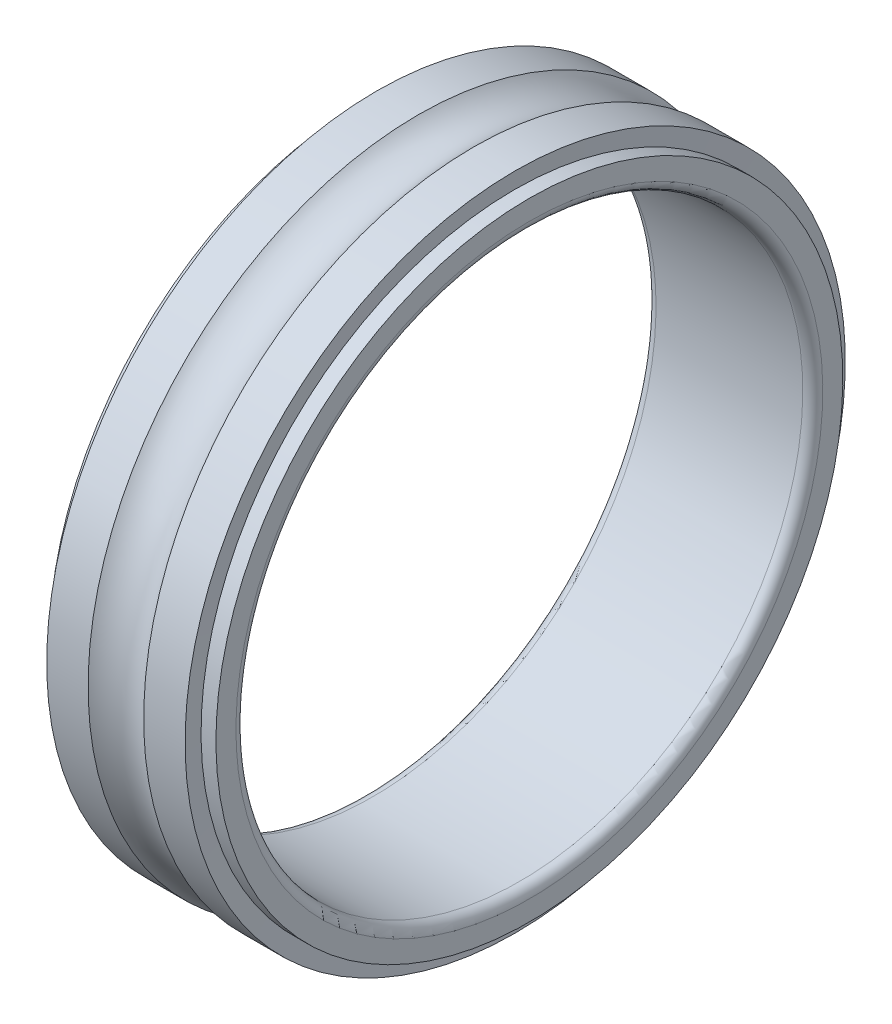
ISO-10303-21;
HEADER;
FILE_DESCRIPTION(('STEP AP214'),'2;1');
FILE_NAME('part.step','',(''),(''),'','','');
FILE_SCHEMA(('AUTOMOTIVE_DESIGN { 1 0 10303 214 1 1 1 1 }'));
ENDSEC;
DATA;
#1=APPLICATION_CONTEXT('core data for automotive mechanical design processes');
#2=APPLICATION_PROTOCOL_DEFINITION('international standard','automotive_design',2000,#1);
#3=PRODUCT_CONTEXT('',#1,'mechanical');
#4=PRODUCT('Part','Part','',(#3));
#5=PRODUCT_RELATED_PRODUCT_CATEGORY('part','',(#4));
#6=PRODUCT_DEFINITION_FORMATION('','',#4);
#7=PRODUCT_DEFINITION_CONTEXT('part definition',#1,'design');
#8=PRODUCT_DEFINITION('design','',#6,#7);
#9=PRODUCT_DEFINITION_SHAPE('','',#8);
#10=(LENGTH_UNIT() NAMED_UNIT(*) SI_UNIT(.MILLI.,.METRE.));
#11=(NAMED_UNIT(*) PLANE_ANGLE_UNIT() SI_UNIT($,.RADIAN.));
#12=(NAMED_UNIT(*) SI_UNIT($,.STERADIAN.) SOLID_ANGLE_UNIT());
#13=UNCERTAINTY_MEASURE_WITH_UNIT(LENGTH_MEASURE(1.E-05),#10,'distance_accuracy_value','');
#14=(GEOMETRIC_REPRESENTATION_CONTEXT(3) GLOBAL_UNCERTAINTY_ASSIGNED_CONTEXT((#13)) GLOBAL_UNIT_ASSIGNED_CONTEXT((#10,
#11,#12)) REPRESENTATION_CONTEXT('',''));
#15=CARTESIAN_POINT('',(0.,0.,0.));
#16=DIRECTION('',(0.,0.,1.));
#17=DIRECTION('',(1.,0.,0.));
#18=AXIS2_PLACEMENT_3D('',#15,#16,#17);
#19=CARTESIAN_POINT('',(0.435915235727127,0.,0.));
#20=DIRECTION('',(-1.,0.,0.));
#21=DIRECTION('',(0.,1.,0.));
#22=AXIS2_PLACEMENT_3D('',#19,#20,#21);
#23=CONICAL_SURFACE('',#22,9.65,1.52716309549504);
#24=CARTESIAN_POINT('',(0.446830471454255,0.,0.));
#25=DIRECTION('',(1.,0.,0.));
#26=DIRECTION('',(0.,1.,0.));
#27=AXIS2_PLACEMENT_3D('',#24,#25,#26);
#28=CIRCLE('',#27,9.4);
#29=CARTESIAN_POINT('',(0.446830471454255,9.4,0.));
#30=VERTEX_POINT('',#29);
#31=EDGE_CURVE('E11',#30,#30,#28,.T.);
#32=ORIENTED_EDGE('',*,*,#31,.T.);
#33=EDGE_LOOP('',(#32));
#34=FACE_BOUND('',#33,.T.);
#35=CARTESIAN_POINT('',(0.425,0.,0.));
#36=DIRECTION('',(1.,0.,0.));
#37=DIRECTION('',(0.,1.,0.));
#38=AXIS2_PLACEMENT_3D('',#35,#36,#37);
#39=CIRCLE('',#38,9.9);
#40=CARTESIAN_POINT('',(0.425,9.9,0.));
#41=VERTEX_POINT('',#40);
#42=EDGE_CURVE('E66',#41,#41,#39,.T.);
#43=ORIENTED_EDGE('',*,*,#42,.F.);
#44=EDGE_LOOP('',(#43));
#45=FACE_BOUND('',#44,.T.);
#46=ADVANCED_FACE('F16',(#34,#45),#23,.F.);
#47=CARTESIAN_POINT('',(0.223415235727128,0.,0.));
#48=DIRECTION('',(-1.,0.,0.));
#49=DIRECTION('',(0.,1.,0.));
#50=AXIS2_PLACEMENT_3D('',#47,#48,#49);
#51=CYLINDRICAL_SURFACE('',#50,9.4);
#52=CARTESIAN_POINT('',(0.,0.,0.));
#53=DIRECTION('',(1.,0.,0.));
#54=DIRECTION('',(0.,1.,0.));
#55=AXIS2_PLACEMENT_3D('',#52,#53,#54);
#56=CIRCLE('',#55,9.4);
#57=CARTESIAN_POINT('',(0.,9.4,0.));
#58=VERTEX_POINT('',#57);
#59=EDGE_CURVE('E25',#58,#58,#56,.T.);
#60=ORIENTED_EDGE('',*,*,#59,.T.);
#61=EDGE_LOOP('',(#60));
#62=FACE_BOUND('',#61,.T.);
#63=ORIENTED_EDGE('',*,*,#31,.F.);
#64=EDGE_LOOP('',(#63));
#65=FACE_BOUND('',#64,.T.);
#66=ADVANCED_FACE('F18',(#62,#65),#51,.T.);
#67=CARTESIAN_POINT('',(0.,9.1,0.));
#68=DIRECTION('',(-1.,0.,0.));
#69=DIRECTION('',(0.,-1.,0.));
#70=AXIS2_PLACEMENT_3D('',#67,#68,#69);
#71=PLANE('',#70);
#72=CARTESIAN_POINT('',(0.,0.,0.));
#73=DIRECTION('',(1.,0.,0.));
#74=DIRECTION('',(0.,1.,0.));
#75=AXIS2_PLACEMENT_3D('',#72,#73,#74);
#76=CIRCLE('',#75,8.8);
#77=CARTESIAN_POINT('',(0.,8.8,0.));
#78=VERTEX_POINT('',#77);
#79=EDGE_CURVE('E86',#78,#78,#76,.T.);
#80=ORIENTED_EDGE('',*,*,#79,.T.);
#81=EDGE_LOOP('',(#80));
#82=FACE_BOUND('',#81,.T.);
#83=ORIENTED_EDGE('',*,*,#59,.F.);
#84=EDGE_LOOP('',(#83));
#85=FACE_BOUND('',#84,.T.);
#86=ADVANCED_FACE('F121',(#82,#85),#71,.T.);
#87=CARTESIAN_POINT('',(0.3,0.,0.));
#88=DIRECTION('',(1.,0.,0.));
#89=DIRECTION('',(0.,0.,-1.));
#90=AXIS2_PLACEMENT_3D('',#87,#88,#89);
#91=TOROIDAL_SURFACE('',#90,8.8,0.3);
#92=CARTESIAN_POINT('',(0.3,0.,0.));
#93=DIRECTION('',(1.,0.,0.));
#94=DIRECTION('',(0.,1.,0.));
#95=AXIS2_PLACEMENT_3D('',#92,#93,#94);
#96=CIRCLE('',#95,8.5);
#97=CARTESIAN_POINT('',(0.3,8.5,0.));
#98=VERTEX_POINT('',#97);
#99=EDGE_CURVE('E82',#98,#98,#96,.T.);
#100=ORIENTED_EDGE('',*,*,#99,.T.);
#101=EDGE_LOOP('',(#100));
#102=FACE_BOUND('',#101,.T.);
#103=ORIENTED_EDGE('',*,*,#79,.F.);
#104=EDGE_LOOP('',(#103));
#105=FACE_BOUND('',#104,.T.);
#106=ADVANCED_FACE('F83',(#102,#105),#91,.T.);
#107=CARTESIAN_POINT('',(2.5,0.,0.));
#108=DIRECTION('',(-1.,0.,0.));
#109=DIRECTION('',(0.,1.,0.));
#110=AXIS2_PLACEMENT_3D('',#107,#108,#109);
#111=CYLINDRICAL_SURFACE('',#110,8.5);
#112=CARTESIAN_POINT('',(4.7,0.,0.));
#113=DIRECTION('',(1.,0.,0.));
#114=DIRECTION('',(0.,1.,0.));
#115=AXIS2_PLACEMENT_3D('',#112,#113,#114);
#116=CIRCLE('',#115,8.5);
#117=CARTESIAN_POINT('',(4.7,8.5,0.));
#118=VERTEX_POINT('',#117);
#119=EDGE_CURVE('E78',#118,#118,#116,.T.);
#120=ORIENTED_EDGE('',*,*,#119,.T.);
#121=EDGE_LOOP('',(#120));
#122=FACE_BOUND('',#121,.T.);
#123=ORIENTED_EDGE('',*,*,#99,.F.);
#124=EDGE_LOOP('',(#123));
#125=FACE_BOUND('',#124,.T.);
#126=ADVANCED_FACE('F127',(#122,#125),#111,.F.);
#127=CARTESIAN_POINT('',(4.7,0.,0.));
#128=DIRECTION('',(1.,0.,0.));
#129=DIRECTION('',(0.,0.,-1.));
#130=AXIS2_PLACEMENT_3D('',#127,#128,#129);
#131=TOROIDAL_SURFACE('',#130,8.8,0.3);
#132=CARTESIAN_POINT('',(5.,0.,0.));
#133=DIRECTION('',(1.,0.,0.));
#134=DIRECTION('',(0.,1.,0.));
#135=AXIS2_PLACEMENT_3D('',#132,#133,#134);
#136=CIRCLE('',#135,8.8);
#137=CARTESIAN_POINT('',(5.,8.8,0.));
#138=VERTEX_POINT('',#137);
#139=EDGE_CURVE('E74',#138,#138,#136,.T.);
#140=ORIENTED_EDGE('',*,*,#139,.T.);
#141=EDGE_LOOP('',(#140));
#142=FACE_BOUND('',#141,.T.);
#143=ORIENTED_EDGE('',*,*,#119,.F.);
#144=EDGE_LOOP('',(#143));
#145=FACE_BOUND('',#144,.T.);
#146=ADVANCED_FACE('F114',(#142,#145),#131,.T.);
#147=CARTESIAN_POINT('',(5.,9.1,0.));
#148=DIRECTION('',(1.,0.,0.));
#149=DIRECTION('',(0.,1.,0.));
#150=AXIS2_PLACEMENT_3D('',#147,#148,#149);
#151=PLANE('',#150);
#152=CARTESIAN_POINT('',(5.,0.,0.));
#153=DIRECTION('',(1.,0.,0.));
#154=DIRECTION('',(0.,1.,0.));
#155=AXIS2_PLACEMENT_3D('',#152,#153,#154);
#156=CIRCLE('',#155,9.4);
#157=CARTESIAN_POINT('',(5.,9.4,0.));
#158=VERTEX_POINT('',#157);
#159=EDGE_CURVE('E92',#158,#158,#156,.T.);
#160=ORIENTED_EDGE('',*,*,#159,.T.);
#161=EDGE_LOOP('',(#160));
#162=FACE_BOUND('',#161,.T.);
#163=ORIENTED_EDGE('',*,*,#139,.F.);
#164=EDGE_LOOP('',(#163));
#165=FACE_BOUND('',#164,.T.);
#166=ADVANCED_FACE('F100',(#162,#165),#151,.T.);
#167=CARTESIAN_POINT('',(4.77658476427287,0.,0.));
#168=DIRECTION('',(-1.,0.,0.));
#169=DIRECTION('',(0.,1.,0.));
#170=AXIS2_PLACEMENT_3D('',#167,#168,#169);
#171=CYLINDRICAL_SURFACE('',#170,9.4);
#172=CARTESIAN_POINT('',(4.55316952854574,0.,0.));
#173=DIRECTION('',(1.,0.,0.));
#174=DIRECTION('',(0.,1.,0.));
#175=AXIS2_PLACEMENT_3D('',#172,#173,#174);
#176=CIRCLE('',#175,9.4);
#177=CARTESIAN_POINT('',(4.55316952854574,9.4,0.));
#178=VERTEX_POINT('',#177);
#179=EDGE_CURVE('E47',#178,#178,#176,.T.);
#180=ORIENTED_EDGE('',*,*,#179,.T.);
#181=EDGE_LOOP('',(#180));
#182=FACE_BOUND('',#181,.T.);
#183=ORIENTED_EDGE('',*,*,#159,.F.);
#184=EDGE_LOOP('',(#183));
#185=FACE_BOUND('',#184,.T.);
#186=ADVANCED_FACE('F103',(#182,#185),#171,.T.);
#187=CARTESIAN_POINT('',(4.56408476427287,0.,0.));
#188=DIRECTION('',(1.,0.,0.));
#189=DIRECTION('',(0.,1.,0.));
#190=AXIS2_PLACEMENT_3D('',#187,#188,#189);
#191=CONICAL_SURFACE('',#190,9.65,1.52716309549504);
#192=CARTESIAN_POINT('',(4.575,0.,0.));
#193=DIRECTION('',(1.,0.,0.));
#194=DIRECTION('',(0.,1.,0.));
#195=AXIS2_PLACEMENT_3D('',#192,#193,#194);
#196=CIRCLE('',#195,9.9);
#197=CARTESIAN_POINT('',(4.575,9.9,0.));
#198=VERTEX_POINT('',#197);
#199=EDGE_CURVE('E56',#198,#198,#196,.T.);
#200=ORIENTED_EDGE('',*,*,#199,.T.);
#201=EDGE_LOOP('',(#200));
#202=FACE_BOUND('',#201,.T.);
#203=ORIENTED_EDGE('',*,*,#179,.F.);
#204=EDGE_LOOP('',(#203));
#205=FACE_BOUND('',#204,.T.);
#206=ADVANCED_FACE('F105',(#202,#205),#191,.F.);
#207=CARTESIAN_POINT('',(3.95427039542174,0.,0.));
#208=DIRECTION('',(-1.,0.,0.));
#209=DIRECTION('',(0.,1.,0.));
#210=AXIS2_PLACEMENT_3D('',#207,#208,#209);
#211=CYLINDRICAL_SURFACE('',#210,9.9);
#212=CARTESIAN_POINT('',(3.33354079084349,0.,0.));
#213=DIRECTION('',(1.,0.,0.));
#214=DIRECTION('',(0.,1.,0.));
#215=AXIS2_PLACEMENT_3D('',#212,#213,#214);
#216=CIRCLE('',#215,9.9);
#217=CARTESIAN_POINT('',(3.33354079084349,9.9,0.));
#218=VERTEX_POINT('',#217);
#219=EDGE_CURVE('E95',#218,#218,#216,.T.);
#220=ORIENTED_EDGE('',*,*,#219,.T.);
#221=EDGE_LOOP('',(#220));
#222=FACE_BOUND('',#221,.T.);
#223=ORIENTED_EDGE('',*,*,#199,.F.);
#224=EDGE_LOOP('',(#223));
#225=FACE_BOUND('',#224,.T.);
#226=ADVANCED_FACE('F112',(#222,#225),#211,.T.);
#227=CARTESIAN_POINT('',(2.5,0.,0.));
#228=DIRECTION('',(1.,0.,0.));
#229=DIRECTION('',(0.,0.,-1.));
#230=AXIS2_PLACEMENT_3D('',#227,#228,#229);
#231=TOROIDAL_SURFACE('',#230,10.75,1.1905);
#232=CARTESIAN_POINT('',(1.66645920915651,0.,0.));
#233=DIRECTION('',(1.,0.,0.));
#234=DIRECTION('',(0.,1.,0.));
#235=AXIS2_PLACEMENT_3D('',#232,#233,#234);
#236=CIRCLE('',#235,9.9);
#237=CARTESIAN_POINT('',(1.66645920915651,9.9,0.));
#238=VERTEX_POINT('',#237);
#239=EDGE_CURVE('E20',#238,#238,#236,.T.);
#240=ORIENTED_EDGE('',*,*,#239,.T.);
#241=EDGE_LOOP('',(#240));
#242=FACE_BOUND('',#241,.T.);
#243=ORIENTED_EDGE('',*,*,#219,.F.);
#244=EDGE_LOOP('',(#243));
#245=FACE_BOUND('',#244,.T.);
#246=ADVANCED_FACE('F125',(#242,#245),#231,.F.);
#247=CARTESIAN_POINT('',(1.04572960457825,0.,0.));
#248=DIRECTION('',(-1.,0.,0.));
#249=DIRECTION('',(0.,1.,0.));
#250=AXIS2_PLACEMENT_3D('',#247,#248,#249);
#251=CYLINDRICAL_SURFACE('',#250,9.9);
#252=ORIENTED_EDGE('',*,*,#42,.T.);
#253=EDGE_LOOP('',(#252));
#254=FACE_BOUND('',#253,.T.);
#255=ORIENTED_EDGE('',*,*,#239,.F.);
#256=EDGE_LOOP('',(#255));
#257=FACE_BOUND('',#256,.T.);
#258=ADVANCED_FACE('F130',(#254,#257),#251,.T.);
#259=CLOSED_SHELL('',(#46,#66,#86,#106,#126,#146,#166,#186,#206,#226,#246,#258));
#260=MANIFOLD_SOLID_BREP('B1',#259);
#261=ADVANCED_BREP_SHAPE_REPRESENTATION('',(#18,#260),#14);
#262=SHAPE_DEFINITION_REPRESENTATION(#9,#261);
ENDSEC;
END-ISO-10303-21;
